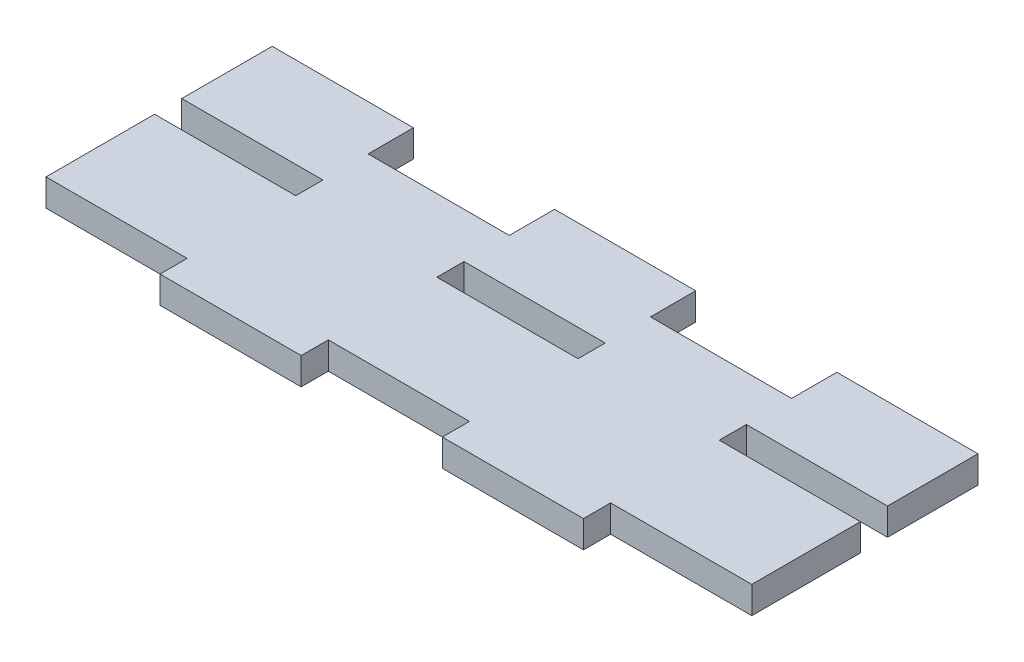
ISO-10303-21;
HEADER;
FILE_DESCRIPTION(('STEP AP214'),'2;1');
FILE_NAME('part.step','',(''),(''),'','','');
FILE_SCHEMA(('AUTOMOTIVE_DESIGN { 1 0 10303 214 1 1 1 1 }'));
ENDSEC;
DATA;
#1=APPLICATION_CONTEXT('core data for automotive mechanical design processes');
#2=APPLICATION_PROTOCOL_DEFINITION('international standard','automotive_design',2000,#1);
#3=PRODUCT_CONTEXT('',#1,'mechanical');
#4=PRODUCT('Part','Part','',(#3));
#5=PRODUCT_RELATED_PRODUCT_CATEGORY('part','',(#4));
#6=PRODUCT_DEFINITION_FORMATION('','',#4);
#7=PRODUCT_DEFINITION_CONTEXT('part definition',#1,'design');
#8=PRODUCT_DEFINITION('design','',#6,#7);
#9=PRODUCT_DEFINITION_SHAPE('','',#8);
#10=(LENGTH_UNIT() NAMED_UNIT(*) SI_UNIT(.MILLI.,.METRE.));
#11=(NAMED_UNIT(*) PLANE_ANGLE_UNIT() SI_UNIT($,.RADIAN.));
#12=(NAMED_UNIT(*) SI_UNIT($,.STERADIAN.) SOLID_ANGLE_UNIT());
#13=UNCERTAINTY_MEASURE_WITH_UNIT(LENGTH_MEASURE(1.E-05),#10,'distance_accuracy_value','');
#14=(GEOMETRIC_REPRESENTATION_CONTEXT(3) GLOBAL_UNCERTAINTY_ASSIGNED_CONTEXT((#13)) GLOBAL_UNIT_ASSIGNED_CONTEXT((#10,
#11,#12)) REPRESENTATION_CONTEXT('',''));
#15=CARTESIAN_POINT('',(0.,0.,0.));
#16=DIRECTION('',(0.,0.,1.));
#17=DIRECTION('',(1.,0.,0.));
#18=AXIS2_PLACEMENT_3D('',#15,#16,#17);
#19=CARTESIAN_POINT('',(0.,3.,0.));
#20=DIRECTION('',(0.,1.,0.));
#21=DIRECTION('',(0.,0.,1.));
#22=AXIS2_PLACEMENT_3D('',#19,#20,#21);
#23=PLANE('',#22);
#24=DIRECTION('',(0.,0.,1.));
#25=VECTOR('',#24,1.);
#26=CARTESIAN_POINT('',(-39.,3.,-10.));
#27=LINE('',#26,#25);
#28=CARTESIAN_POINT('',(-39.,3.,-10.));
#29=VERTEX_POINT('',#28);
#30=CARTESIAN_POINT('',(-39.,3.,0.));
#31=VERTEX_POINT('',#30);
#32=EDGE_CURVE('E277',#29,#31,#27,.T.);
#33=ORIENTED_EDGE('',*,*,#32,.T.);
#34=DIRECTION('',(1.,0.,0.));
#35=VECTOR('',#34,1.);
#36=CARTESIAN_POINT('',(-39.,3.,0.));
#37=LINE('',#36,#35);
#38=CARTESIAN_POINT('',(-23.4,3.,0.));
#39=VERTEX_POINT('',#38);
#40=EDGE_CURVE('E280',#31,#39,#37,.T.);
#41=ORIENTED_EDGE('',*,*,#40,.T.);
#42=DIRECTION('',(0.,0.,1.));
#43=VECTOR('',#42,1.);
#44=CARTESIAN_POINT('',(-23.4,3.,0.));
#45=LINE('',#44,#43);
#46=CARTESIAN_POINT('',(-23.4,3.,3.));
#47=VERTEX_POINT('',#46);
#48=EDGE_CURVE('E283',#39,#47,#45,.T.);
#49=ORIENTED_EDGE('',*,*,#48,.T.);
#50=DIRECTION('',(-1.,0.,0.));
#51=VECTOR('',#50,1.);
#52=CARTESIAN_POINT('',(-39.,3.,3.));
#53=LINE('',#52,#51);
#54=CARTESIAN_POINT('',(-39.,3.,3.));
#55=VERTEX_POINT('',#54);
#56=EDGE_CURVE('E285',#47,#55,#53,.T.);
#57=ORIENTED_EDGE('',*,*,#56,.T.);
#58=DIRECTION('',(0.,0.,1.));
#59=VECTOR('',#58,1.);
#60=CARTESIAN_POINT('',(-39.,3.,3.));
#61=LINE('',#60,#59);
#62=CARTESIAN_POINT('',(-39.,3.,15.));
#63=VERTEX_POINT('',#62);
#64=EDGE_CURVE('E287',#55,#63,#61,.T.);
#65=ORIENTED_EDGE('',*,*,#64,.T.);
#66=DIRECTION('',(1.,0.,0.));
#67=VECTOR('',#66,1.);
#68=CARTESIAN_POINT('',(-39.,3.,15.));
#69=LINE('',#68,#67);
#70=CARTESIAN_POINT('',(-23.4,3.,15.));
#71=VERTEX_POINT('',#70);
#72=EDGE_CURVE('E289',#63,#71,#69,.T.);
#73=ORIENTED_EDGE('',*,*,#72,.T.);
#74=DIRECTION('',(0.,0.,1.));
#75=VECTOR('',#74,1.);
#76=CARTESIAN_POINT('',(-23.4,3.,18.));
#77=LINE('',#76,#75);
#78=CARTESIAN_POINT('',(-23.4,3.,18.));
#79=VERTEX_POINT('',#78);
#80=EDGE_CURVE('E291',#71,#79,#77,.T.);
#81=ORIENTED_EDGE('',*,*,#80,.T.);
#82=DIRECTION('',(1.,0.,0.));
#83=VECTOR('',#82,1.);
#84=CARTESIAN_POINT('',(-23.4,3.,18.));
#85=LINE('',#84,#83);
#86=CARTESIAN_POINT('',(-7.8,3.,18.));
#87=VERTEX_POINT('',#86);
#88=EDGE_CURVE('E293',#79,#87,#85,.T.);
#89=ORIENTED_EDGE('',*,*,#88,.T.);
#90=DIRECTION('',(0.,0.,-1.));
#91=VECTOR('',#90,1.);
#92=CARTESIAN_POINT('',(-7.8,3.,18.));
#93=LINE('',#92,#91);
#94=CARTESIAN_POINT('',(-7.8,3.,15.));
#95=VERTEX_POINT('',#94);
#96=EDGE_CURVE('E295',#87,#95,#93,.T.);
#97=ORIENTED_EDGE('',*,*,#96,.T.);
#98=DIRECTION('',(1.,0.,0.));
#99=VECTOR('',#98,1.);
#100=CARTESIAN_POINT('',(-7.8,3.,15.));
#101=LINE('',#100,#99);
#102=CARTESIAN_POINT('',(7.8,3.,15.));
#103=VERTEX_POINT('',#102);
#104=EDGE_CURVE('E297',#95,#103,#101,.T.);
#105=ORIENTED_EDGE('',*,*,#104,.T.);
#106=DIRECTION('',(0.,0.,1.));
#107=VECTOR('',#106,1.);
#108=CARTESIAN_POINT('',(7.8,3.,18.));
#109=LINE('',#108,#107);
#110=CARTESIAN_POINT('',(7.8,3.,18.));
#111=VERTEX_POINT('',#110);
#112=EDGE_CURVE('E299',#103,#111,#109,.T.);
#113=ORIENTED_EDGE('',*,*,#112,.T.);
#114=DIRECTION('',(1.,0.,0.));
#115=VECTOR('',#114,1.);
#116=CARTESIAN_POINT('',(7.8,3.,18.));
#117=LINE('',#116,#115);
#118=CARTESIAN_POINT('',(23.4,3.,18.));
#119=VERTEX_POINT('',#118);
#120=EDGE_CURVE('E301',#111,#119,#117,.T.);
#121=ORIENTED_EDGE('',*,*,#120,.T.);
#122=DIRECTION('',(0.,0.,-1.));
#123=VECTOR('',#122,1.);
#124=CARTESIAN_POINT('',(23.4,3.,18.));
#125=LINE('',#124,#123);
#126=CARTESIAN_POINT('',(23.4,3.,15.));
#127=VERTEX_POINT('',#126);
#128=EDGE_CURVE('E303',#119,#127,#125,.T.);
#129=ORIENTED_EDGE('',*,*,#128,.T.);
#130=DIRECTION('',(1.,0.,0.));
#131=VECTOR('',#130,1.);
#132=CARTESIAN_POINT('',(23.4,3.,15.));
#133=LINE('',#132,#131);
#134=CARTESIAN_POINT('',(39.,3.,15.));
#135=VERTEX_POINT('',#134);
#136=EDGE_CURVE('E305',#127,#135,#133,.T.);
#137=ORIENTED_EDGE('',*,*,#136,.T.);
#138=DIRECTION('',(0.,0.,-1.));
#139=VECTOR('',#138,1.);
#140=CARTESIAN_POINT('',(39.,3.,3.));
#141=LINE('',#140,#139);
#142=CARTESIAN_POINT('',(39.,3.,3.));
#143=VERTEX_POINT('',#142);
#144=EDGE_CURVE('E307',#135,#143,#141,.T.);
#145=ORIENTED_EDGE('',*,*,#144,.T.);
#146=DIRECTION('',(-1.,0.,0.));
#147=VECTOR('',#146,1.);
#148=CARTESIAN_POINT('',(23.4,3.,3.));
#149=LINE('',#148,#147);
#150=CARTESIAN_POINT('',(23.4,3.,3.));
#151=VERTEX_POINT('',#150);
#152=EDGE_CURVE('E309',#143,#151,#149,.T.);
#153=ORIENTED_EDGE('',*,*,#152,.T.);
#154=DIRECTION('',(0.,0.,-1.));
#155=VECTOR('',#154,1.);
#156=CARTESIAN_POINT('',(23.4,3.,0.));
#157=LINE('',#156,#155);
#158=CARTESIAN_POINT('',(23.4,3.,0.));
#159=VERTEX_POINT('',#158);
#160=EDGE_CURVE('E311',#151,#159,#157,.T.);
#161=ORIENTED_EDGE('',*,*,#160,.T.);
#162=DIRECTION('',(1.,0.,0.));
#163=VECTOR('',#162,1.);
#164=CARTESIAN_POINT('',(23.4,3.,0.));
#165=LINE('',#164,#163);
#166=CARTESIAN_POINT('',(39.,3.,0.));
#167=VERTEX_POINT('',#166);
#168=EDGE_CURVE('E313',#159,#167,#165,.T.);
#169=ORIENTED_EDGE('',*,*,#168,.T.);
#170=DIRECTION('',(0.,0.,-1.));
#171=VECTOR('',#170,1.);
#172=CARTESIAN_POINT('',(39.,3.,-10.));
#173=LINE('',#172,#171);
#174=CARTESIAN_POINT('',(39.,3.,-10.));
#175=VERTEX_POINT('',#174);
#176=EDGE_CURVE('E315',#167,#175,#173,.T.);
#177=ORIENTED_EDGE('',*,*,#176,.T.);
#178=DIRECTION('',(-1.,0.,0.));
#179=VECTOR('',#178,1.);
#180=CARTESIAN_POINT('',(23.4,3.,-10.));
#181=LINE('',#180,#179);
#182=CARTESIAN_POINT('',(23.4,3.,-10.));
#183=VERTEX_POINT('',#182);
#184=EDGE_CURVE('E317',#175,#183,#181,.T.);
#185=ORIENTED_EDGE('',*,*,#184,.T.);
#186=DIRECTION('',(0.,0.,1.));
#187=VECTOR('',#186,1.);
#188=CARTESIAN_POINT('',(23.4,3.,-10.));
#189=LINE('',#188,#187);
#190=CARTESIAN_POINT('',(23.4,3.,-5.));
#191=VERTEX_POINT('',#190);
#192=EDGE_CURVE('E319',#183,#191,#189,.T.);
#193=ORIENTED_EDGE('',*,*,#192,.T.);
#194=DIRECTION('',(-1.,0.,0.));
#195=VECTOR('',#194,1.);
#196=CARTESIAN_POINT('',(7.8,3.,-5.));
#197=LINE('',#196,#195);
#198=CARTESIAN_POINT('',(7.8,3.,-5.));
#199=VERTEX_POINT('',#198);
#200=EDGE_CURVE('E321',#191,#199,#197,.T.);
#201=ORIENTED_EDGE('',*,*,#200,.T.);
#202=DIRECTION('',(0.,0.,-1.));
#203=VECTOR('',#202,1.);
#204=CARTESIAN_POINT('',(7.8,3.,-10.));
#205=LINE('',#204,#203);
#206=CARTESIAN_POINT('',(7.8,3.,-10.));
#207=VERTEX_POINT('',#206);
#208=EDGE_CURVE('E323',#199,#207,#205,.T.);
#209=ORIENTED_EDGE('',*,*,#208,.T.);
#210=DIRECTION('',(-1.,0.,0.));
#211=VECTOR('',#210,1.);
#212=CARTESIAN_POINT('',(-7.8,3.,-10.));
#213=LINE('',#212,#211);
#214=CARTESIAN_POINT('',(-7.8,3.,-10.));
#215=VERTEX_POINT('',#214);
#216=EDGE_CURVE('E325',#207,#215,#213,.T.);
#217=ORIENTED_EDGE('',*,*,#216,.T.);
#218=DIRECTION('',(0.,0.,1.));
#219=VECTOR('',#218,1.);
#220=CARTESIAN_POINT('',(-7.8,3.,-10.));
#221=LINE('',#220,#219);
#222=CARTESIAN_POINT('',(-7.8,3.,-5.));
#223=VERTEX_POINT('',#222);
#224=EDGE_CURVE('E327',#215,#223,#221,.T.);
#225=ORIENTED_EDGE('',*,*,#224,.T.);
#226=DIRECTION('',(-1.,0.,0.));
#227=VECTOR('',#226,1.);
#228=CARTESIAN_POINT('',(-23.4,3.,-5.));
#229=LINE('',#228,#227);
#230=CARTESIAN_POINT('',(-23.4,3.,-5.));
#231=VERTEX_POINT('',#230);
#232=EDGE_CURVE('E329',#223,#231,#229,.T.);
#233=ORIENTED_EDGE('',*,*,#232,.T.);
#234=DIRECTION('',(0.,0.,-1.));
#235=VECTOR('',#234,1.);
#236=CARTESIAN_POINT('',(-23.4,3.,-10.));
#237=LINE('',#236,#235);
#238=CARTESIAN_POINT('',(-23.4,3.,-10.));
#239=VERTEX_POINT('',#238);
#240=EDGE_CURVE('E331',#231,#239,#237,.T.);
#241=ORIENTED_EDGE('',*,*,#240,.T.);
#242=DIRECTION('',(-1.,0.,0.));
#243=VECTOR('',#242,1.);
#244=CARTESIAN_POINT('',(-39.,3.,-10.));
#245=LINE('',#244,#243);
#246=EDGE_CURVE('E333',#239,#29,#245,.T.);
#247=ORIENTED_EDGE('',*,*,#246,.T.);
#248=EDGE_LOOP('',(#33,#41,#49,#57,#65,#73,#81,#89,#97,#105,#113,#121,#129,#137,#145,#153,#161,
#169,#177,#185,#193,#201,#209,#217,#225,#233,#241,#247));
#249=FACE_BOUND('',#248,.T.);
#250=DIRECTION('',(1.,0.,0.));
#251=VECTOR('',#250,1.);
#252=CARTESIAN_POINT('',(-7.8,3.,3.));
#253=LINE('',#252,#251);
#254=CARTESIAN_POINT('',(-7.8,3.,3.));
#255=VERTEX_POINT('',#254);
#256=CARTESIAN_POINT('',(7.8,3.,3.));
#257=VERTEX_POINT('',#256);
#258=EDGE_CURVE('E249',#255,#257,#253,.T.);
#259=ORIENTED_EDGE('',*,*,#258,.F.);
#260=DIRECTION('',(0.,0.,1.));
#261=VECTOR('',#260,1.);
#262=CARTESIAN_POINT('',(-7.8,3.,0.));
#263=LINE('',#262,#261);
#264=CARTESIAN_POINT('',(-7.8,3.,0.));
#265=VERTEX_POINT('',#264);
#266=EDGE_CURVE('E241',#265,#255,#263,.T.);
#267=ORIENTED_EDGE('',*,*,#266,.F.);
#268=DIRECTION('',(-1.,0.,0.));
#269=VECTOR('',#268,1.);
#270=CARTESIAN_POINT('',(-7.8,3.,0.));
#271=LINE('',#270,#269);
#272=CARTESIAN_POINT('',(7.8,3.,0.));
#273=VERTEX_POINT('',#272);
#274=EDGE_CURVE('E263',#273,#265,#271,.T.);
#275=ORIENTED_EDGE('',*,*,#274,.F.);
#276=DIRECTION('',(0.,0.,-1.));
#277=VECTOR('',#276,1.);
#278=CARTESIAN_POINT('',(7.8,3.,0.));
#279=LINE('',#278,#277);
#280=EDGE_CURVE('E261',#257,#273,#279,.T.);
#281=ORIENTED_EDGE('',*,*,#280,.F.);
#282=EDGE_LOOP('',(#259,#267,#275,#281));
#283=FACE_BOUND('',#282,.T.);
#284=ADVANCED_FACE('F32',(#249,#283),#23,.T.);
#285=CARTESIAN_POINT('',(0.,0.,0.));
#286=DIRECTION('',(0.,1.,0.));
#287=DIRECTION('',(0.,0.,1.));
#288=AXIS2_PLACEMENT_3D('',#285,#286,#287);
#289=PLANE('',#288);
#290=DIRECTION('',(0.,0.,1.));
#291=VECTOR('',#290,1.);
#292=CARTESIAN_POINT('',(-39.,0.,-10.));
#293=LINE('',#292,#291);
#294=CARTESIAN_POINT('',(-39.,0.,-10.));
#295=VERTEX_POINT('',#294);
#296=CARTESIAN_POINT('',(-39.,0.,0.));
#297=VERTEX_POINT('',#296);
#298=EDGE_CURVE('E257',#295,#297,#293,.T.);
#299=ORIENTED_EDGE('',*,*,#298,.F.);
#300=DIRECTION('',(-1.,0.,0.));
#301=VECTOR('',#300,1.);
#302=CARTESIAN_POINT('',(-39.,0.,-10.));
#303=LINE('',#302,#301);
#304=CARTESIAN_POINT('',(-23.4,0.,-10.));
#305=VERTEX_POINT('',#304);
#306=EDGE_CURVE('E281',#305,#295,#303,.T.);
#307=ORIENTED_EDGE('',*,*,#306,.F.);
#308=DIRECTION('',(0.,0.,-1.));
#309=VECTOR('',#308,1.);
#310=CARTESIAN_POINT('',(-23.4,0.,-10.));
#311=LINE('',#310,#309);
#312=CARTESIAN_POINT('',(-23.4,0.,-5.));
#313=VERTEX_POINT('',#312);
#314=EDGE_CURVE('E388',#313,#305,#311,.T.);
#315=ORIENTED_EDGE('',*,*,#314,.F.);
#316=DIRECTION('',(-1.,0.,0.));
#317=VECTOR('',#316,1.);
#318=CARTESIAN_POINT('',(-23.4,0.,-5.));
#319=LINE('',#318,#317);
#320=CARTESIAN_POINT('',(-7.8,0.,-5.));
#321=VERTEX_POINT('',#320);
#322=EDGE_CURVE('E386',#321,#313,#319,.T.);
#323=ORIENTED_EDGE('',*,*,#322,.F.);
#324=DIRECTION('',(0.,0.,1.));
#325=VECTOR('',#324,1.);
#326=CARTESIAN_POINT('',(-7.8,0.,-10.));
#327=LINE('',#326,#325);
#328=CARTESIAN_POINT('',(-7.8,0.,-10.));
#329=VERTEX_POINT('',#328);
#330=EDGE_CURVE('E384',#329,#321,#327,.T.);
#331=ORIENTED_EDGE('',*,*,#330,.F.);
#332=DIRECTION('',(-1.,0.,0.));
#333=VECTOR('',#332,1.);
#334=CARTESIAN_POINT('',(-7.8,0.,-10.));
#335=LINE('',#334,#333);
#336=CARTESIAN_POINT('',(7.8,0.,-10.));
#337=VERTEX_POINT('',#336);
#338=EDGE_CURVE('E382',#337,#329,#335,.T.);
#339=ORIENTED_EDGE('',*,*,#338,.F.);
#340=DIRECTION('',(0.,0.,-1.));
#341=VECTOR('',#340,1.);
#342=CARTESIAN_POINT('',(7.8,0.,-10.));
#343=LINE('',#342,#341);
#344=CARTESIAN_POINT('',(7.8,0.,-5.));
#345=VERTEX_POINT('',#344);
#346=EDGE_CURVE('E380',#345,#337,#343,.T.);
#347=ORIENTED_EDGE('',*,*,#346,.F.);
#348=DIRECTION('',(-1.,0.,0.));
#349=VECTOR('',#348,1.);
#350=CARTESIAN_POINT('',(7.8,0.,-5.));
#351=LINE('',#350,#349);
#352=CARTESIAN_POINT('',(23.4,0.,-5.));
#353=VERTEX_POINT('',#352);
#354=EDGE_CURVE('E378',#353,#345,#351,.T.);
#355=ORIENTED_EDGE('',*,*,#354,.F.);
#356=DIRECTION('',(0.,0.,1.));
#357=VECTOR('',#356,1.);
#358=CARTESIAN_POINT('',(23.4,0.,-10.));
#359=LINE('',#358,#357);
#360=CARTESIAN_POINT('',(23.4,0.,-10.));
#361=VERTEX_POINT('',#360);
#362=EDGE_CURVE('E376',#361,#353,#359,.T.);
#363=ORIENTED_EDGE('',*,*,#362,.F.);
#364=DIRECTION('',(-1.,0.,0.));
#365=VECTOR('',#364,1.);
#366=CARTESIAN_POINT('',(23.4,0.,-10.));
#367=LINE('',#366,#365);
#368=CARTESIAN_POINT('',(39.,0.,-10.));
#369=VERTEX_POINT('',#368);
#370=EDGE_CURVE('E374',#369,#361,#367,.T.);
#371=ORIENTED_EDGE('',*,*,#370,.F.);
#372=DIRECTION('',(0.,0.,-1.));
#373=VECTOR('',#372,1.);
#374=CARTESIAN_POINT('',(39.,0.,-10.));
#375=LINE('',#374,#373);
#376=CARTESIAN_POINT('',(39.,0.,0.));
#377=VERTEX_POINT('',#376);
#378=EDGE_CURVE('E372',#377,#369,#375,.T.);
#379=ORIENTED_EDGE('',*,*,#378,.F.);
#380=DIRECTION('',(1.,0.,0.));
#381=VECTOR('',#380,1.);
#382=CARTESIAN_POINT('',(23.4,0.,0.));
#383=LINE('',#382,#381);
#384=CARTESIAN_POINT('',(23.4,0.,0.));
#385=VERTEX_POINT('',#384);
#386=EDGE_CURVE('E370',#385,#377,#383,.T.);
#387=ORIENTED_EDGE('',*,*,#386,.F.);
#388=DIRECTION('',(0.,0.,-1.));
#389=VECTOR('',#388,1.);
#390=CARTESIAN_POINT('',(23.4,0.,0.));
#391=LINE('',#390,#389);
#392=CARTESIAN_POINT('',(23.4,0.,3.));
#393=VERTEX_POINT('',#392);
#394=EDGE_CURVE('E368',#393,#385,#391,.T.);
#395=ORIENTED_EDGE('',*,*,#394,.F.);
#396=DIRECTION('',(-1.,0.,0.));
#397=VECTOR('',#396,1.);
#398=CARTESIAN_POINT('',(23.4,0.,3.));
#399=LINE('',#398,#397);
#400=CARTESIAN_POINT('',(39.,0.,3.));
#401=VERTEX_POINT('',#400);
#402=EDGE_CURVE('E366',#401,#393,#399,.T.);
#403=ORIENTED_EDGE('',*,*,#402,.F.);
#404=DIRECTION('',(0.,0.,-1.));
#405=VECTOR('',#404,1.);
#406=CARTESIAN_POINT('',(39.,0.,3.));
#407=LINE('',#406,#405);
#408=CARTESIAN_POINT('',(39.,0.,15.));
#409=VERTEX_POINT('',#408);
#410=EDGE_CURVE('E364',#409,#401,#407,.T.);
#411=ORIENTED_EDGE('',*,*,#410,.F.);
#412=DIRECTION('',(1.,0.,0.));
#413=VECTOR('',#412,1.);
#414=CARTESIAN_POINT('',(23.4,0.,15.));
#415=LINE('',#414,#413);
#416=CARTESIAN_POINT('',(23.4,0.,15.));
#417=VERTEX_POINT('',#416);
#418=EDGE_CURVE('E362',#417,#409,#415,.T.);
#419=ORIENTED_EDGE('',*,*,#418,.F.);
#420=DIRECTION('',(0.,0.,-1.));
#421=VECTOR('',#420,1.);
#422=CARTESIAN_POINT('',(23.4,0.,18.));
#423=LINE('',#422,#421);
#424=CARTESIAN_POINT('',(23.4,0.,18.));
#425=VERTEX_POINT('',#424);
#426=EDGE_CURVE('E360',#425,#417,#423,.T.);
#427=ORIENTED_EDGE('',*,*,#426,.F.);
#428=DIRECTION('',(1.,0.,0.));
#429=VECTOR('',#428,1.);
#430=CARTESIAN_POINT('',(7.8,0.,18.));
#431=LINE('',#430,#429);
#432=CARTESIAN_POINT('',(7.8,0.,18.));
#433=VERTEX_POINT('',#432);
#434=EDGE_CURVE('E358',#433,#425,#431,.T.);
#435=ORIENTED_EDGE('',*,*,#434,.F.);
#436=DIRECTION('',(0.,0.,1.));
#437=VECTOR('',#436,1.);
#438=CARTESIAN_POINT('',(7.8,0.,18.));
#439=LINE('',#438,#437);
#440=CARTESIAN_POINT('',(7.8,0.,15.));
#441=VERTEX_POINT('',#440);
#442=EDGE_CURVE('E356',#441,#433,#439,.T.);
#443=ORIENTED_EDGE('',*,*,#442,.F.);
#444=DIRECTION('',(1.,0.,0.));
#445=VECTOR('',#444,1.);
#446=CARTESIAN_POINT('',(-7.8,0.,15.));
#447=LINE('',#446,#445);
#448=CARTESIAN_POINT('',(-7.8,0.,15.));
#449=VERTEX_POINT('',#448);
#450=EDGE_CURVE('E354',#449,#441,#447,.T.);
#451=ORIENTED_EDGE('',*,*,#450,.F.);
#452=DIRECTION('',(0.,0.,-1.));
#453=VECTOR('',#452,1.);
#454=CARTESIAN_POINT('',(-7.8,0.,18.));
#455=LINE('',#454,#453);
#456=CARTESIAN_POINT('',(-7.8,0.,18.));
#457=VERTEX_POINT('',#456);
#458=EDGE_CURVE('E352',#457,#449,#455,.T.);
#459=ORIENTED_EDGE('',*,*,#458,.F.);
#460=DIRECTION('',(1.,0.,0.));
#461=VECTOR('',#460,1.);
#462=CARTESIAN_POINT('',(-23.4,0.,18.));
#463=LINE('',#462,#461);
#464=CARTESIAN_POINT('',(-23.4,0.,18.));
#465=VERTEX_POINT('',#464);
#466=EDGE_CURVE('E350',#465,#457,#463,.T.);
#467=ORIENTED_EDGE('',*,*,#466,.F.);
#468=DIRECTION('',(0.,0.,1.));
#469=VECTOR('',#468,1.);
#470=CARTESIAN_POINT('',(-23.4,0.,18.));
#471=LINE('',#470,#469);
#472=CARTESIAN_POINT('',(-23.4,0.,15.));
#473=VERTEX_POINT('',#472);
#474=EDGE_CURVE('E348',#473,#465,#471,.T.);
#475=ORIENTED_EDGE('',*,*,#474,.F.);
#476=DIRECTION('',(1.,0.,0.));
#477=VECTOR('',#476,1.);
#478=CARTESIAN_POINT('',(-39.,0.,15.));
#479=LINE('',#478,#477);
#480=CARTESIAN_POINT('',(-39.,0.,15.));
#481=VERTEX_POINT('',#480);
#482=EDGE_CURVE('E346',#481,#473,#479,.T.);
#483=ORIENTED_EDGE('',*,*,#482,.F.);
#484=DIRECTION('',(0.,0.,1.));
#485=VECTOR('',#484,1.);
#486=CARTESIAN_POINT('',(-39.,0.,3.));
#487=LINE('',#486,#485);
#488=CARTESIAN_POINT('',(-39.,0.,3.));
#489=VERTEX_POINT('',#488);
#490=EDGE_CURVE('E344',#489,#481,#487,.T.);
#491=ORIENTED_EDGE('',*,*,#490,.F.);
#492=DIRECTION('',(-1.,0.,0.));
#493=VECTOR('',#492,1.);
#494=CARTESIAN_POINT('',(-39.,0.,3.));
#495=LINE('',#494,#493);
#496=CARTESIAN_POINT('',(-23.4,0.,3.));
#497=VERTEX_POINT('',#496);
#498=EDGE_CURVE('E342',#497,#489,#495,.T.);
#499=ORIENTED_EDGE('',*,*,#498,.F.);
#500=DIRECTION('',(0.,0.,1.));
#501=VECTOR('',#500,1.);
#502=CARTESIAN_POINT('',(-23.4,0.,0.));
#503=LINE('',#502,#501);
#504=CARTESIAN_POINT('',(-23.4,0.,0.));
#505=VERTEX_POINT('',#504);
#506=EDGE_CURVE('E340',#505,#497,#503,.T.);
#507=ORIENTED_EDGE('',*,*,#506,.F.);
#508=DIRECTION('',(1.,0.,0.));
#509=VECTOR('',#508,1.);
#510=CARTESIAN_POINT('',(-39.,0.,0.));
#511=LINE('',#510,#509);
#512=EDGE_CURVE('E338',#297,#505,#511,.T.);
#513=ORIENTED_EDGE('',*,*,#512,.F.);
#514=EDGE_LOOP('',(#299,#307,#315,#323,#331,#339,#347,#355,#363,#371,#379,#387,#395,#403,#411,
#419,#427,#435,#443,#451,#459,#467,#475,#483,#491,#499,#507,#513));
#515=FACE_BOUND('',#514,.T.);
#516=DIRECTION('',(0.,0.,1.));
#517=VECTOR('',#516,1.);
#518=CARTESIAN_POINT('',(-7.8,0.,0.));
#519=LINE('',#518,#517);
#520=CARTESIAN_POINT('',(-7.8,0.,0.));
#521=VERTEX_POINT('',#520);
#522=CARTESIAN_POINT('',(-7.8,0.,3.));
#523=VERTEX_POINT('',#522);
#524=EDGE_CURVE('E55',#521,#523,#519,.T.);
#525=ORIENTED_EDGE('',*,*,#524,.T.);
#526=DIRECTION('',(1.,0.,0.));
#527=VECTOR('',#526,1.);
#528=CARTESIAN_POINT('',(-7.8,0.,3.));
#529=LINE('',#528,#527);
#530=CARTESIAN_POINT('',(7.8,0.,3.));
#531=VERTEX_POINT('',#530);
#532=EDGE_CURVE('E256',#523,#531,#529,.T.);
#533=ORIENTED_EDGE('',*,*,#532,.T.);
#534=DIRECTION('',(0.,0.,-1.));
#535=VECTOR('',#534,1.);
#536=CARTESIAN_POINT('',(7.8,0.,0.));
#537=LINE('',#536,#535);
#538=CARTESIAN_POINT('',(7.8,0.,0.));
#539=VERTEX_POINT('',#538);
#540=EDGE_CURVE('E269',#531,#539,#537,.T.);
#541=ORIENTED_EDGE('',*,*,#540,.T.);
#542=DIRECTION('',(-1.,0.,0.));
#543=VECTOR('',#542,1.);
#544=CARTESIAN_POINT('',(-7.8,0.,0.));
#545=LINE('',#544,#543);
#546=EDGE_CURVE('E250',#539,#521,#545,.T.);
#547=ORIENTED_EDGE('',*,*,#546,.T.);
#548=EDGE_LOOP('',(#525,#533,#541,#547));
#549=FACE_BOUND('',#548,.T.);
#550=ADVANCED_FACE('F478',(#515,#549),#289,.F.);
#551=CARTESIAN_POINT('',(-39.,3.,-10.));
#552=DIRECTION('',(1.,0.,0.));
#553=DIRECTION('',(0.,0.,-1.));
#554=AXIS2_PLACEMENT_3D('',#551,#552,#553);
#555=PLANE('',#554);
#556=ORIENTED_EDGE('',*,*,#298,.T.);
#557=DIRECTION('',(0.,-1.,0.));
#558=VECTOR('',#557,1.);
#559=CARTESIAN_POINT('',(-39.,3.,0.));
#560=LINE('',#559,#558);
#561=EDGE_CURVE('E11',#31,#297,#560,.T.);
#562=ORIENTED_EDGE('',*,*,#561,.F.);
#563=ORIENTED_EDGE('',*,*,#32,.F.);
#564=DIRECTION('',(0.,-1.,0.));
#565=VECTOR('',#564,1.);
#566=CARTESIAN_POINT('',(-39.,3.,-10.));
#567=LINE('',#566,#565);
#568=EDGE_CURVE('E335',#29,#295,#567,.T.);
#569=ORIENTED_EDGE('',*,*,#568,.T.);
#570=EDGE_LOOP('',(#556,#562,#563,#569));
#571=FACE_BOUND('',#570,.T.);
#572=ADVANCED_FACE('F34',(#571),#555,.F.);
#573=CARTESIAN_POINT('',(-39.,3.,0.));
#574=DIRECTION('',(0.,0.,-1.));
#575=DIRECTION('',(-1.,0.,0.));
#576=AXIS2_PLACEMENT_3D('',#573,#574,#575);
#577=PLANE('',#576);
#578=ORIENTED_EDGE('',*,*,#512,.T.);
#579=DIRECTION('',(0.,-1.,0.));
#580=VECTOR('',#579,1.);
#581=CARTESIAN_POINT('',(-23.4,3.,0.));
#582=LINE('',#581,#580);
#583=EDGE_CURVE('E40',#39,#505,#582,.T.);
#584=ORIENTED_EDGE('',*,*,#583,.F.);
#585=ORIENTED_EDGE('',*,*,#40,.F.);
#586=ORIENTED_EDGE('',*,*,#561,.T.);
#587=EDGE_LOOP('',(#578,#584,#585,#586));
#588=FACE_BOUND('',#587,.T.);
#589=ADVANCED_FACE('F495',(#588),#577,.F.);
#590=CARTESIAN_POINT('',(-23.4,3.,0.));
#591=DIRECTION('',(1.,0.,0.));
#592=DIRECTION('',(0.,0.,-1.));
#593=AXIS2_PLACEMENT_3D('',#590,#591,#592);
#594=PLANE('',#593);
#595=ORIENTED_EDGE('',*,*,#506,.T.);
#596=DIRECTION('',(0.,-1.,0.));
#597=VECTOR('',#596,1.);
#598=CARTESIAN_POINT('',(-23.4,3.,3.));
#599=LINE('',#598,#597);
#600=EDGE_CURVE('E465',#47,#497,#599,.T.);
#601=ORIENTED_EDGE('',*,*,#600,.F.);
#602=ORIENTED_EDGE('',*,*,#48,.F.);
#603=ORIENTED_EDGE('',*,*,#583,.T.);
#604=EDGE_LOOP('',(#595,#601,#602,#603));
#605=FACE_BOUND('',#604,.T.);
#606=ADVANCED_FACE('F472',(#605),#594,.F.);
#607=CARTESIAN_POINT('',(-39.,3.,3.));
#608=DIRECTION('',(0.,0.,1.));
#609=DIRECTION('',(1.,0.,0.));
#610=AXIS2_PLACEMENT_3D('',#607,#608,#609);
#611=PLANE('',#610);
#612=ORIENTED_EDGE('',*,*,#498,.T.);
#613=DIRECTION('',(0.,-1.,0.));
#614=VECTOR('',#613,1.);
#615=CARTESIAN_POINT('',(-39.,3.,3.));
#616=LINE('',#615,#614);
#617=EDGE_CURVE('E462',#55,#489,#616,.T.);
#618=ORIENTED_EDGE('',*,*,#617,.F.);
#619=ORIENTED_EDGE('',*,*,#56,.F.);
#620=ORIENTED_EDGE('',*,*,#600,.T.);
#621=EDGE_LOOP('',(#612,#618,#619,#620));
#622=FACE_BOUND('',#621,.T.);
#623=ADVANCED_FACE('F484',(#622),#611,.F.);
#624=CARTESIAN_POINT('',(-39.,3.,3.));
#625=DIRECTION('',(1.,0.,0.));
#626=DIRECTION('',(0.,0.,-1.));
#627=AXIS2_PLACEMENT_3D('',#624,#625,#626);
#628=PLANE('',#627);
#629=ORIENTED_EDGE('',*,*,#490,.T.);
#630=DIRECTION('',(0.,-1.,0.));
#631=VECTOR('',#630,1.);
#632=CARTESIAN_POINT('',(-39.,3.,15.));
#633=LINE('',#632,#631);
#634=EDGE_CURVE('E459',#63,#481,#633,.T.);
#635=ORIENTED_EDGE('',*,*,#634,.F.);
#636=ORIENTED_EDGE('',*,*,#64,.F.);
#637=ORIENTED_EDGE('',*,*,#617,.T.);
#638=EDGE_LOOP('',(#629,#635,#636,#637));
#639=FACE_BOUND('',#638,.T.);
#640=ADVANCED_FACE('F488',(#639),#628,.F.);
#641=CARTESIAN_POINT('',(-39.,3.,15.));
#642=DIRECTION('',(0.,0.,-1.));
#643=DIRECTION('',(-1.,0.,0.));
#644=AXIS2_PLACEMENT_3D('',#641,#642,#643);
#645=PLANE('',#644);
#646=ORIENTED_EDGE('',*,*,#482,.T.);
#647=DIRECTION('',(0.,-1.,0.));
#648=VECTOR('',#647,1.);
#649=CARTESIAN_POINT('',(-23.4,3.,15.));
#650=LINE('',#649,#648);
#651=EDGE_CURVE('E456',#71,#473,#650,.T.);
#652=ORIENTED_EDGE('',*,*,#651,.F.);
#653=ORIENTED_EDGE('',*,*,#72,.F.);
#654=ORIENTED_EDGE('',*,*,#634,.T.);
#655=EDGE_LOOP('',(#646,#652,#653,#654));
#656=FACE_BOUND('',#655,.T.);
#657=ADVANCED_FACE('F608',(#656),#645,.F.);
#658=CARTESIAN_POINT('',(-23.4,3.,18.));
#659=DIRECTION('',(1.,0.,0.));
#660=DIRECTION('',(0.,0.,-1.));
#661=AXIS2_PLACEMENT_3D('',#658,#659,#660);
#662=PLANE('',#661);
#663=ORIENTED_EDGE('',*,*,#474,.T.);
#664=DIRECTION('',(0.,-1.,0.));
#665=VECTOR('',#664,1.);
#666=CARTESIAN_POINT('',(-23.4,3.,18.));
#667=LINE('',#666,#665);
#668=EDGE_CURVE('E453',#79,#465,#667,.T.);
#669=ORIENTED_EDGE('',*,*,#668,.F.);
#670=ORIENTED_EDGE('',*,*,#80,.F.);
#671=ORIENTED_EDGE('',*,*,#651,.T.);
#672=EDGE_LOOP('',(#663,#669,#670,#671));
#673=FACE_BOUND('',#672,.T.);
#674=ADVANCED_FACE('F605',(#673),#662,.F.);
#675=CARTESIAN_POINT('',(-23.4,3.,18.));
#676=DIRECTION('',(0.,0.,-1.));
#677=DIRECTION('',(-1.,0.,0.));
#678=AXIS2_PLACEMENT_3D('',#675,#676,#677);
#679=PLANE('',#678);
#680=ORIENTED_EDGE('',*,*,#466,.T.);
#681=DIRECTION('',(0.,-1.,0.));
#682=VECTOR('',#681,1.);
#683=CARTESIAN_POINT('',(-7.8,3.,18.));
#684=LINE('',#683,#682);
#685=EDGE_CURVE('E450',#87,#457,#684,.T.);
#686=ORIENTED_EDGE('',*,*,#685,.F.);
#687=ORIENTED_EDGE('',*,*,#88,.F.);
#688=ORIENTED_EDGE('',*,*,#668,.T.);
#689=EDGE_LOOP('',(#680,#686,#687,#688));
#690=FACE_BOUND('',#689,.T.);
#691=ADVANCED_FACE('F601',(#690),#679,.F.);
#692=CARTESIAN_POINT('',(-7.8,3.,18.));
#693=DIRECTION('',(-1.,0.,0.));
#694=DIRECTION('',(0.,0.,1.));
#695=AXIS2_PLACEMENT_3D('',#692,#693,#694);
#696=PLANE('',#695);
#697=ORIENTED_EDGE('',*,*,#458,.T.);
#698=DIRECTION('',(0.,-1.,0.));
#699=VECTOR('',#698,1.);
#700=CARTESIAN_POINT('',(-7.8,3.,15.));
#701=LINE('',#700,#699);
#702=EDGE_CURVE('E447',#95,#449,#701,.T.);
#703=ORIENTED_EDGE('',*,*,#702,.F.);
#704=ORIENTED_EDGE('',*,*,#96,.F.);
#705=ORIENTED_EDGE('',*,*,#685,.T.);
#706=EDGE_LOOP('',(#697,#703,#704,#705));
#707=FACE_BOUND('',#706,.T.);
#708=ADVANCED_FACE('F597',(#707),#696,.F.);
#709=CARTESIAN_POINT('',(-7.8,3.,15.));
#710=DIRECTION('',(0.,0.,-1.));
#711=DIRECTION('',(-1.,0.,0.));
#712=AXIS2_PLACEMENT_3D('',#709,#710,#711);
#713=PLANE('',#712);
#714=ORIENTED_EDGE('',*,*,#450,.T.);
#715=DIRECTION('',(0.,-1.,0.));
#716=VECTOR('',#715,1.);
#717=CARTESIAN_POINT('',(7.8,3.,15.));
#718=LINE('',#717,#716);
#719=EDGE_CURVE('E444',#103,#441,#718,.T.);
#720=ORIENTED_EDGE('',*,*,#719,.F.);
#721=ORIENTED_EDGE('',*,*,#104,.F.);
#722=ORIENTED_EDGE('',*,*,#702,.T.);
#723=EDGE_LOOP('',(#714,#720,#721,#722));
#724=FACE_BOUND('',#723,.T.);
#725=ADVANCED_FACE('F592',(#724),#713,.F.);
#726=CARTESIAN_POINT('',(7.8,3.,18.));
#727=DIRECTION('',(1.,0.,0.));
#728=DIRECTION('',(0.,0.,-1.));
#729=AXIS2_PLACEMENT_3D('',#726,#727,#728);
#730=PLANE('',#729);
#731=ORIENTED_EDGE('',*,*,#442,.T.);
#732=DIRECTION('',(0.,-1.,0.));
#733=VECTOR('',#732,1.);
#734=CARTESIAN_POINT('',(7.8,3.,18.));
#735=LINE('',#734,#733);
#736=EDGE_CURVE('E441',#111,#433,#735,.T.);
#737=ORIENTED_EDGE('',*,*,#736,.F.);
#738=ORIENTED_EDGE('',*,*,#112,.F.);
#739=ORIENTED_EDGE('',*,*,#719,.T.);
#740=EDGE_LOOP('',(#731,#737,#738,#739));
#741=FACE_BOUND('',#740,.T.);
#742=ADVANCED_FACE('F586',(#741),#730,.F.);
#743=CARTESIAN_POINT('',(7.8,3.,18.));
#744=DIRECTION('',(0.,0.,-1.));
#745=DIRECTION('',(-1.,0.,0.));
#746=AXIS2_PLACEMENT_3D('',#743,#744,#745);
#747=PLANE('',#746);
#748=ORIENTED_EDGE('',*,*,#434,.T.);
#749=DIRECTION('',(0.,-1.,0.));
#750=VECTOR('',#749,1.);
#751=CARTESIAN_POINT('',(23.4,3.,18.));
#752=LINE('',#751,#750);
#753=EDGE_CURVE('E438',#119,#425,#752,.T.);
#754=ORIENTED_EDGE('',*,*,#753,.F.);
#755=ORIENTED_EDGE('',*,*,#120,.F.);
#756=ORIENTED_EDGE('',*,*,#736,.T.);
#757=EDGE_LOOP('',(#748,#754,#755,#756));
#758=FACE_BOUND('',#757,.T.);
#759=ADVANCED_FACE('F582',(#758),#747,.F.);
#760=CARTESIAN_POINT('',(23.4,3.,18.));
#761=DIRECTION('',(-1.,0.,0.));
#762=DIRECTION('',(0.,0.,1.));
#763=AXIS2_PLACEMENT_3D('',#760,#761,#762);
#764=PLANE('',#763);
#765=ORIENTED_EDGE('',*,*,#426,.T.);
#766=DIRECTION('',(0.,-1.,0.));
#767=VECTOR('',#766,1.);
#768=CARTESIAN_POINT('',(23.4,3.,15.));
#769=LINE('',#768,#767);
#770=EDGE_CURVE('E435',#127,#417,#769,.T.);
#771=ORIENTED_EDGE('',*,*,#770,.F.);
#772=ORIENTED_EDGE('',*,*,#128,.F.);
#773=ORIENTED_EDGE('',*,*,#753,.T.);
#774=EDGE_LOOP('',(#765,#771,#772,#773));
#775=FACE_BOUND('',#774,.T.);
#776=ADVANCED_FACE('F577',(#775),#764,.F.);
#777=CARTESIAN_POINT('',(23.4,3.,15.));
#778=DIRECTION('',(0.,0.,-1.));
#779=DIRECTION('',(-1.,0.,0.));
#780=AXIS2_PLACEMENT_3D('',#777,#778,#779);
#781=PLANE('',#780);
#782=ORIENTED_EDGE('',*,*,#418,.T.);
#783=DIRECTION('',(0.,-1.,0.));
#784=VECTOR('',#783,1.);
#785=CARTESIAN_POINT('',(39.,3.,15.));
#786=LINE('',#785,#784);
#787=EDGE_CURVE('E432',#135,#409,#786,.T.);
#788=ORIENTED_EDGE('',*,*,#787,.F.);
#789=ORIENTED_EDGE('',*,*,#136,.F.);
#790=ORIENTED_EDGE('',*,*,#770,.T.);
#791=EDGE_LOOP('',(#782,#788,#789,#790));
#792=FACE_BOUND('',#791,.T.);
#793=ADVANCED_FACE('F571',(#792),#781,.F.);
#794=CARTESIAN_POINT('',(39.,3.,3.));
#795=DIRECTION('',(-1.,0.,0.));
#796=DIRECTION('',(0.,0.,1.));
#797=AXIS2_PLACEMENT_3D('',#794,#795,#796);
#798=PLANE('',#797);
#799=ORIENTED_EDGE('',*,*,#410,.T.);
#800=DIRECTION('',(0.,-1.,0.));
#801=VECTOR('',#800,1.);
#802=CARTESIAN_POINT('',(39.,3.,3.));
#803=LINE('',#802,#801);
#804=EDGE_CURVE('E429',#143,#401,#803,.T.);
#805=ORIENTED_EDGE('',*,*,#804,.F.);
#806=ORIENTED_EDGE('',*,*,#144,.F.);
#807=ORIENTED_EDGE('',*,*,#787,.T.);
#808=EDGE_LOOP('',(#799,#805,#806,#807));
#809=FACE_BOUND('',#808,.T.);
#810=ADVANCED_FACE('F567',(#809),#798,.F.);
#811=CARTESIAN_POINT('',(23.4,3.,3.));
#812=DIRECTION('',(0.,0.,1.));
#813=DIRECTION('',(1.,0.,0.));
#814=AXIS2_PLACEMENT_3D('',#811,#812,#813);
#815=PLANE('',#814);
#816=ORIENTED_EDGE('',*,*,#402,.T.);
#817=DIRECTION('',(0.,-1.,0.));
#818=VECTOR('',#817,1.);
#819=CARTESIAN_POINT('',(23.4,3.,3.));
#820=LINE('',#819,#818);
#821=EDGE_CURVE('E426',#151,#393,#820,.T.);
#822=ORIENTED_EDGE('',*,*,#821,.F.);
#823=ORIENTED_EDGE('',*,*,#152,.F.);
#824=ORIENTED_EDGE('',*,*,#804,.T.);
#825=EDGE_LOOP('',(#816,#822,#823,#824));
#826=FACE_BOUND('',#825,.T.);
#827=ADVANCED_FACE('F562',(#826),#815,.F.);
#828=CARTESIAN_POINT('',(23.4,3.,0.));
#829=DIRECTION('',(-1.,0.,0.));
#830=DIRECTION('',(0.,0.,1.));
#831=AXIS2_PLACEMENT_3D('',#828,#829,#830);
#832=PLANE('',#831);
#833=ORIENTED_EDGE('',*,*,#394,.T.);
#834=DIRECTION('',(0.,-1.,0.));
#835=VECTOR('',#834,1.);
#836=CARTESIAN_POINT('',(23.4,3.,0.));
#837=LINE('',#836,#835);
#838=EDGE_CURVE('E423',#159,#385,#837,.T.);
#839=ORIENTED_EDGE('',*,*,#838,.F.);
#840=ORIENTED_EDGE('',*,*,#160,.F.);
#841=ORIENTED_EDGE('',*,*,#821,.T.);
#842=EDGE_LOOP('',(#833,#839,#840,#841));
#843=FACE_BOUND('',#842,.T.);
#844=ADVANCED_FACE('F556',(#843),#832,.F.);
#845=CARTESIAN_POINT('',(23.4,3.,0.));
#846=DIRECTION('',(0.,0.,-1.));
#847=DIRECTION('',(-1.,0.,0.));
#848=AXIS2_PLACEMENT_3D('',#845,#846,#847);
#849=PLANE('',#848);
#850=ORIENTED_EDGE('',*,*,#386,.T.);
#851=DIRECTION('',(0.,-1.,0.));
#852=VECTOR('',#851,1.);
#853=CARTESIAN_POINT('',(39.,3.,0.));
#854=LINE('',#853,#852);
#855=EDGE_CURVE('E420',#167,#377,#854,.T.);
#856=ORIENTED_EDGE('',*,*,#855,.F.);
#857=ORIENTED_EDGE('',*,*,#168,.F.);
#858=ORIENTED_EDGE('',*,*,#838,.T.);
#859=EDGE_LOOP('',(#850,#856,#857,#858));
#860=FACE_BOUND('',#859,.T.);
#861=ADVANCED_FACE('F552',(#860),#849,.F.);
#862=CARTESIAN_POINT('',(39.,3.,-10.));
#863=DIRECTION('',(-1.,0.,0.));
#864=DIRECTION('',(0.,0.,1.));
#865=AXIS2_PLACEMENT_3D('',#862,#863,#864);
#866=PLANE('',#865);
#867=ORIENTED_EDGE('',*,*,#378,.T.);
#868=DIRECTION('',(0.,-1.,0.));
#869=VECTOR('',#868,1.);
#870=CARTESIAN_POINT('',(39.,3.,-10.));
#871=LINE('',#870,#869);
#872=EDGE_CURVE('E417',#175,#369,#871,.T.);
#873=ORIENTED_EDGE('',*,*,#872,.F.);
#874=ORIENTED_EDGE('',*,*,#176,.F.);
#875=ORIENTED_EDGE('',*,*,#855,.T.);
#876=EDGE_LOOP('',(#867,#873,#874,#875));
#877=FACE_BOUND('',#876,.T.);
#878=ADVANCED_FACE('F547',(#877),#866,.F.);
#879=CARTESIAN_POINT('',(23.4,3.,-10.));
#880=DIRECTION('',(0.,0.,1.));
#881=DIRECTION('',(1.,0.,0.));
#882=AXIS2_PLACEMENT_3D('',#879,#880,#881);
#883=PLANE('',#882);
#884=ORIENTED_EDGE('',*,*,#370,.T.);
#885=DIRECTION('',(0.,-1.,0.));
#886=VECTOR('',#885,1.);
#887=CARTESIAN_POINT('',(23.4,3.,-10.));
#888=LINE('',#887,#886);
#889=EDGE_CURVE('E414',#183,#361,#888,.T.);
#890=ORIENTED_EDGE('',*,*,#889,.F.);
#891=ORIENTED_EDGE('',*,*,#184,.F.);
#892=ORIENTED_EDGE('',*,*,#872,.T.);
#893=EDGE_LOOP('',(#884,#890,#891,#892));
#894=FACE_BOUND('',#893,.T.);
#895=ADVANCED_FACE('F541',(#894),#883,.F.);
#896=CARTESIAN_POINT('',(23.4,3.,-10.));
#897=DIRECTION('',(1.,0.,0.));
#898=DIRECTION('',(0.,0.,-1.));
#899=AXIS2_PLACEMENT_3D('',#896,#897,#898);
#900=PLANE('',#899);
#901=ORIENTED_EDGE('',*,*,#362,.T.);
#902=DIRECTION('',(0.,-1.,0.));
#903=VECTOR('',#902,1.);
#904=CARTESIAN_POINT('',(23.4,3.,-5.));
#905=LINE('',#904,#903);
#906=EDGE_CURVE('E411',#191,#353,#905,.T.);
#907=ORIENTED_EDGE('',*,*,#906,.F.);
#908=ORIENTED_EDGE('',*,*,#192,.F.);
#909=ORIENTED_EDGE('',*,*,#889,.T.);
#910=EDGE_LOOP('',(#901,#907,#908,#909));
#911=FACE_BOUND('',#910,.T.);
#912=ADVANCED_FACE('F537',(#911),#900,.F.);
#913=CARTESIAN_POINT('',(7.8,3.,-5.));
#914=DIRECTION('',(0.,0.,1.));
#915=DIRECTION('',(1.,0.,0.));
#916=AXIS2_PLACEMENT_3D('',#913,#914,#915);
#917=PLANE('',#916);
#918=ORIENTED_EDGE('',*,*,#354,.T.);
#919=DIRECTION('',(0.,-1.,0.));
#920=VECTOR('',#919,1.);
#921=CARTESIAN_POINT('',(7.8,3.,-5.));
#922=LINE('',#921,#920);
#923=EDGE_CURVE('E408',#199,#345,#922,.T.);
#924=ORIENTED_EDGE('',*,*,#923,.F.);
#925=ORIENTED_EDGE('',*,*,#200,.F.);
#926=ORIENTED_EDGE('',*,*,#906,.T.);
#927=EDGE_LOOP('',(#918,#924,#925,#926));
#928=FACE_BOUND('',#927,.T.);
#929=ADVANCED_FACE('F532',(#928),#917,.F.);
#930=CARTESIAN_POINT('',(7.8,3.,-10.));
#931=DIRECTION('',(-1.,0.,0.));
#932=DIRECTION('',(0.,0.,1.));
#933=AXIS2_PLACEMENT_3D('',#930,#931,#932);
#934=PLANE('',#933);
#935=ORIENTED_EDGE('',*,*,#346,.T.);
#936=DIRECTION('',(0.,-1.,0.));
#937=VECTOR('',#936,1.);
#938=CARTESIAN_POINT('',(7.8,3.,-10.));
#939=LINE('',#938,#937);
#940=EDGE_CURVE('E405',#207,#337,#939,.T.);
#941=ORIENTED_EDGE('',*,*,#940,.F.);
#942=ORIENTED_EDGE('',*,*,#208,.F.);
#943=ORIENTED_EDGE('',*,*,#923,.T.);
#944=EDGE_LOOP('',(#935,#941,#942,#943));
#945=FACE_BOUND('',#944,.T.);
#946=ADVANCED_FACE('F526',(#945),#934,.F.);
#947=CARTESIAN_POINT('',(-7.8,3.,-10.));
#948=DIRECTION('',(0.,0.,1.));
#949=DIRECTION('',(1.,0.,0.));
#950=AXIS2_PLACEMENT_3D('',#947,#948,#949);
#951=PLANE('',#950);
#952=ORIENTED_EDGE('',*,*,#338,.T.);
#953=DIRECTION('',(0.,-1.,0.));
#954=VECTOR('',#953,1.);
#955=CARTESIAN_POINT('',(-7.8,3.,-10.));
#956=LINE('',#955,#954);
#957=EDGE_CURVE('E402',#215,#329,#956,.T.);
#958=ORIENTED_EDGE('',*,*,#957,.F.);
#959=ORIENTED_EDGE('',*,*,#216,.F.);
#960=ORIENTED_EDGE('',*,*,#940,.T.);
#961=EDGE_LOOP('',(#952,#958,#959,#960));
#962=FACE_BOUND('',#961,.T.);
#963=ADVANCED_FACE('F522',(#962),#951,.F.);
#964=CARTESIAN_POINT('',(-7.8,3.,-10.));
#965=DIRECTION('',(1.,0.,0.));
#966=DIRECTION('',(0.,0.,-1.));
#967=AXIS2_PLACEMENT_3D('',#964,#965,#966);
#968=PLANE('',#967);
#969=ORIENTED_EDGE('',*,*,#330,.T.);
#970=DIRECTION('',(0.,-1.,0.));
#971=VECTOR('',#970,1.);
#972=CARTESIAN_POINT('',(-7.8,3.,-5.));
#973=LINE('',#972,#971);
#974=EDGE_CURVE('E399',#223,#321,#973,.T.);
#975=ORIENTED_EDGE('',*,*,#974,.F.);
#976=ORIENTED_EDGE('',*,*,#224,.F.);
#977=ORIENTED_EDGE('',*,*,#957,.T.);
#978=EDGE_LOOP('',(#969,#975,#976,#977));
#979=FACE_BOUND('',#978,.T.);
#980=ADVANCED_FACE('F517',(#979),#968,.F.);
#981=CARTESIAN_POINT('',(-23.4,3.,-5.));
#982=DIRECTION('',(0.,0.,1.));
#983=DIRECTION('',(1.,0.,0.));
#984=AXIS2_PLACEMENT_3D('',#981,#982,#983);
#985=PLANE('',#984);
#986=ORIENTED_EDGE('',*,*,#322,.T.);
#987=DIRECTION('',(0.,-1.,0.));
#988=VECTOR('',#987,1.);
#989=CARTESIAN_POINT('',(-23.4,3.,-5.));
#990=LINE('',#989,#988);
#991=EDGE_CURVE('E396',#231,#313,#990,.T.);
#992=ORIENTED_EDGE('',*,*,#991,.F.);
#993=ORIENTED_EDGE('',*,*,#232,.F.);
#994=ORIENTED_EDGE('',*,*,#974,.T.);
#995=EDGE_LOOP('',(#986,#992,#993,#994));
#996=FACE_BOUND('',#995,.T.);
#997=ADVANCED_FACE('F511',(#996),#985,.F.);
#998=CARTESIAN_POINT('',(-23.4,3.,-10.));
#999=DIRECTION('',(-1.,0.,0.));
#1000=DIRECTION('',(0.,0.,1.));
#1001=AXIS2_PLACEMENT_3D('',#998,#999,#1000);
#1002=PLANE('',#1001);
#1003=ORIENTED_EDGE('',*,*,#314,.T.);
#1004=DIRECTION('',(0.,-1.,0.));
#1005=VECTOR('',#1004,1.);
#1006=CARTESIAN_POINT('',(-23.4,3.,-10.));
#1007=LINE('',#1006,#1005);
#1008=EDGE_CURVE('E393',#239,#305,#1007,.T.);
#1009=ORIENTED_EDGE('',*,*,#1008,.F.);
#1010=ORIENTED_EDGE('',*,*,#240,.F.);
#1011=ORIENTED_EDGE('',*,*,#991,.T.);
#1012=EDGE_LOOP('',(#1003,#1009,#1010,#1011));
#1013=FACE_BOUND('',#1012,.T.);
#1014=ADVANCED_FACE('F507',(#1013),#1002,.F.);
#1015=CARTESIAN_POINT('',(-39.,3.,-10.));
#1016=DIRECTION('',(0.,0.,1.));
#1017=DIRECTION('',(1.,0.,0.));
#1018=AXIS2_PLACEMENT_3D('',#1015,#1016,#1017);
#1019=PLANE('',#1018);
#1020=ORIENTED_EDGE('',*,*,#306,.T.);
#1021=ORIENTED_EDGE('',*,*,#568,.F.);
#1022=ORIENTED_EDGE('',*,*,#246,.F.);
#1023=ORIENTED_EDGE('',*,*,#1008,.T.);
#1024=EDGE_LOOP('',(#1020,#1021,#1022,#1023));
#1025=FACE_BOUND('',#1024,.T.);
#1026=ADVANCED_FACE('F502',(#1025),#1019,.F.);
#1027=CARTESIAN_POINT('',(-7.8,3.,0.));
#1028=DIRECTION('',(1.,0.,0.));
#1029=DIRECTION('',(0.,0.,-1.));
#1030=AXIS2_PLACEMENT_3D('',#1027,#1028,#1029);
#1031=PLANE('',#1030);
#1032=ORIENTED_EDGE('',*,*,#524,.F.);
#1033=DIRECTION('',(0.,-1.,0.));
#1034=VECTOR('',#1033,1.);
#1035=CARTESIAN_POINT('',(-7.8,3.,0.));
#1036=LINE('',#1035,#1034);
#1037=EDGE_CURVE('E245',#265,#521,#1036,.T.);
#1038=ORIENTED_EDGE('',*,*,#1037,.F.);
#1039=ORIENTED_EDGE('',*,*,#266,.T.);
#1040=DIRECTION('',(0.,-1.,0.));
#1041=VECTOR('',#1040,1.);
#1042=CARTESIAN_POINT('',(-7.8,3.,3.));
#1043=LINE('',#1042,#1041);
#1044=EDGE_CURVE('E244',#255,#523,#1043,.T.);
#1045=ORIENTED_EDGE('',*,*,#1044,.T.);
#1046=EDGE_LOOP('',(#1032,#1038,#1039,#1045));
#1047=FACE_BOUND('',#1046,.T.);
#1048=ADVANCED_FACE('F243',(#1047),#1031,.T.);
#1049=CARTESIAN_POINT('',(-7.8,3.,3.));
#1050=DIRECTION('',(0.,0.,-1.));
#1051=DIRECTION('',(-1.,0.,0.));
#1052=AXIS2_PLACEMENT_3D('',#1049,#1050,#1051);
#1053=PLANE('',#1052);
#1054=ORIENTED_EDGE('',*,*,#532,.F.);
#1055=ORIENTED_EDGE('',*,*,#1044,.F.);
#1056=ORIENTED_EDGE('',*,*,#258,.T.);
#1057=DIRECTION('',(0.,-1.,0.));
#1058=VECTOR('',#1057,1.);
#1059=CARTESIAN_POINT('',(7.8,3.,3.));
#1060=LINE('',#1059,#1058);
#1061=EDGE_CURVE('E258',#257,#531,#1060,.T.);
#1062=ORIENTED_EDGE('',*,*,#1061,.T.);
#1063=EDGE_LOOP('',(#1054,#1055,#1056,#1062));
#1064=FACE_BOUND('',#1063,.T.);
#1065=ADVANCED_FACE('F253',(#1064),#1053,.T.);
#1066=CARTESIAN_POINT('',(7.8,3.,0.));
#1067=DIRECTION('',(-1.,0.,0.));
#1068=DIRECTION('',(0.,0.,1.));
#1069=AXIS2_PLACEMENT_3D('',#1066,#1067,#1068);
#1070=PLANE('',#1069);
#1071=ORIENTED_EDGE('',*,*,#540,.F.);
#1072=ORIENTED_EDGE('',*,*,#1061,.F.);
#1073=ORIENTED_EDGE('',*,*,#280,.T.);
#1074=DIRECTION('',(0.,-1.,0.));
#1075=VECTOR('',#1074,1.);
#1076=CARTESIAN_POINT('',(7.8,3.,0.));
#1077=LINE('',#1076,#1075);
#1078=EDGE_CURVE('E47',#273,#539,#1077,.T.);
#1079=ORIENTED_EDGE('',*,*,#1078,.T.);
#1080=EDGE_LOOP('',(#1071,#1072,#1073,#1079));
#1081=FACE_BOUND('',#1080,.T.);
#1082=ADVANCED_FACE('F762',(#1081),#1070,.T.);
#1083=CARTESIAN_POINT('',(-7.8,3.,0.));
#1084=DIRECTION('',(0.,0.,1.));
#1085=DIRECTION('',(1.,0.,0.));
#1086=AXIS2_PLACEMENT_3D('',#1083,#1084,#1085);
#1087=PLANE('',#1086);
#1088=ORIENTED_EDGE('',*,*,#546,.F.);
#1089=ORIENTED_EDGE('',*,*,#1078,.F.);
#1090=ORIENTED_EDGE('',*,*,#274,.T.);
#1091=ORIENTED_EDGE('',*,*,#1037,.T.);
#1092=EDGE_LOOP('',(#1088,#1089,#1090,#1091));
#1093=FACE_BOUND('',#1092,.T.);
#1094=ADVANCED_FACE('F768',(#1093),#1087,.T.);
#1095=CLOSED_SHELL('',(#284,#550,#572,#589,#606,#623,#640,#657,#674,#691,#708,#725,#742,#759,
#776,#793,#810,#827,#844,#861,#878,#895,#912,#929,#946,#963,#980,#997,#1014,#1026,#1048,#1065,
#1082,#1094));
#1096=MANIFOLD_SOLID_BREP('B2',#1095);
#1097=ADVANCED_BREP_SHAPE_REPRESENTATION('',(#18,#1096),#14);
#1098=SHAPE_DEFINITION_REPRESENTATION(#9,#1097);
ENDSEC;
END-ISO-10303-21;
